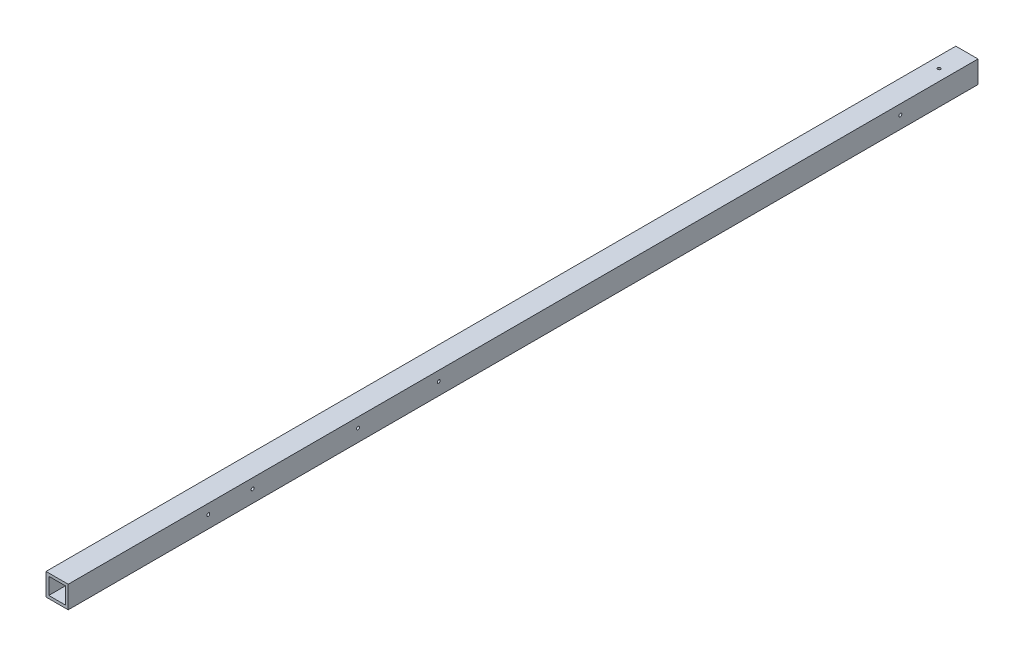
ISO-10303-21;
HEADER;
FILE_DESCRIPTION(('STEP AP214'),'2;1');
FILE_NAME('part.step','',(''),(''),'','','');
FILE_SCHEMA(('AUTOMOTIVE_DESIGN { 1 0 10303 214 1 1 1 1 }'));
ENDSEC;
DATA;
#1=APPLICATION_CONTEXT('core data for automotive mechanical design processes');
#2=APPLICATION_PROTOCOL_DEFINITION('international standard','automotive_design',2000,#1);
#3=PRODUCT_CONTEXT('',#1,'mechanical');
#4=PRODUCT('Part','Part','',(#3));
#5=PRODUCT_RELATED_PRODUCT_CATEGORY('part','',(#4));
#6=PRODUCT_DEFINITION_FORMATION('','',#4);
#7=PRODUCT_DEFINITION_CONTEXT('part definition',#1,'design');
#8=PRODUCT_DEFINITION('design','',#6,#7);
#9=PRODUCT_DEFINITION_SHAPE('','',#8);
#10=(LENGTH_UNIT() NAMED_UNIT(*) SI_UNIT(.MILLI.,.METRE.));
#11=(NAMED_UNIT(*) PLANE_ANGLE_UNIT() SI_UNIT($,.RADIAN.));
#12=(NAMED_UNIT(*) SI_UNIT($,.STERADIAN.) SOLID_ANGLE_UNIT());
#13=UNCERTAINTY_MEASURE_WITH_UNIT(LENGTH_MEASURE(1.E-05),#10,'distance_accuracy_value','');
#14=(GEOMETRIC_REPRESENTATION_CONTEXT(3) GLOBAL_UNCERTAINTY_ASSIGNED_CONTEXT((#13)) GLOBAL_UNIT_ASSIGNED_CONTEXT((#10,
#11,#12)) REPRESENTATION_CONTEXT('',''));
#15=CARTESIAN_POINT('',(0.,0.,0.));
#16=DIRECTION('',(0.,0.,1.));
#17=DIRECTION('',(1.,0.,0.));
#18=AXIS2_PLACEMENT_3D('',#15,#16,#17);
#19=CARTESIAN_POINT('',(-2287.62139438171,193.675,1762.125));
#20=DIRECTION('',(1.,0.,0.));
#21=DIRECTION('',(0.,0.,-1.));
#22=AXIS2_PLACEMENT_3D('',#19,#20,#21);
#23=CYLINDRICAL_SURFACE('',#22,3.3782);
#24=CARTESIAN_POINT('',(-209.55,193.675,1762.125));
#25=DIRECTION('',(-1.,0.,0.));
#26=DIRECTION('',(0.,0.,-1.));
#27=AXIS2_PLACEMENT_3D('',#24,#25,#26);
#28=CIRCLE('',#27,3.3782);
#29=CARTESIAN_POINT('',(-209.55,193.675,1758.7468));
#30=VERTEX_POINT('',#29);
#31=EDGE_CURVE('E195',#30,#30,#28,.F.);
#32=ORIENTED_EDGE('',*,*,#31,.T.);
#33=EDGE_LOOP('',(#32));
#34=FACE_BOUND('',#33,.T.);
#35=CARTESIAN_POINT('',(-212.028435125498,193.675,1762.125));
#36=DIRECTION('',(1.,0.,0.));
#37=DIRECTION('',(0.,0.,1.));
#38=AXIS2_PLACEMENT_3D('',#35,#36,#37);
#39=CIRCLE('',#38,3.3782);
#40=CARTESIAN_POINT('',(-212.028435125498,193.675,1765.5032));
#41=VERTEX_POINT('',#40);
#42=EDGE_CURVE('E259',#41,#41,#39,.T.);
#43=ORIENTED_EDGE('',*,*,#42,.F.);
#44=EDGE_LOOP('',(#43));
#45=FACE_BOUND('',#44,.T.);
#46=ADVANCED_FACE('F14',(#34,#45),#23,.F.);
#47=CARTESIAN_POINT('',(-2287.62139438171,193.675,1660.525));
#48=DIRECTION('',(1.,0.,0.));
#49=DIRECTION('',(0.,0.,-1.));
#50=AXIS2_PLACEMENT_3D('',#47,#48,#49);
#51=CYLINDRICAL_SURFACE('',#50,3.3782);
#52=CARTESIAN_POINT('',(-209.55,193.675,1660.525));
#53=DIRECTION('',(-1.,0.,0.));
#54=DIRECTION('',(0.,0.,-1.));
#55=AXIS2_PLACEMENT_3D('',#52,#53,#54);
#56=CIRCLE('',#55,3.3782);
#57=CARTESIAN_POINT('',(-209.55,193.675,1657.1468));
#58=VERTEX_POINT('',#57);
#59=EDGE_CURVE('E201',#58,#58,#56,.F.);
#60=ORIENTED_EDGE('',*,*,#59,.T.);
#61=EDGE_LOOP('',(#60));
#62=FACE_BOUND('',#61,.T.);
#63=CARTESIAN_POINT('',(-212.028435125498,193.675,1660.525));
#64=DIRECTION('',(1.,0.,0.));
#65=DIRECTION('',(0.,0.,1.));
#66=AXIS2_PLACEMENT_3D('',#63,#64,#65);
#67=CIRCLE('',#66,3.3782);
#68=CARTESIAN_POINT('',(-212.028435125498,193.675,1663.9032));
#69=VERTEX_POINT('',#68);
#70=EDGE_CURVE('E206',#69,#69,#67,.T.);
#71=ORIENTED_EDGE('',*,*,#70,.F.);
#72=EDGE_LOOP('',(#71));
#73=FACE_BOUND('',#72,.T.);
#74=ADVANCED_FACE('F337',(#62,#73),#51,.F.);
#75=CARTESIAN_POINT('',(-190.5,171.45,2082.8));
#76=DIRECTION('',(0.,1.,0.));
#77=DIRECTION('',(0.,0.,-1.));
#78=AXIS2_PLACEMENT_3D('',#75,#76,#77);
#79=PLANE('',#78);
#80=CARTESIAN_POINT('',(-190.5,171.45,63.5));
#81=DIRECTION('',(0.,-1.,0.));
#82=DIRECTION('',(0.,0.,-1.));
#83=AXIS2_PLACEMENT_3D('',#80,#81,#82);
#84=CIRCLE('',#83,3.3655);
#85=CARTESIAN_POINT('',(-190.5,171.45,60.1345));
#86=VERTEX_POINT('',#85);
#87=EDGE_CURVE('E148',#86,#86,#84,.F.);
#88=ORIENTED_EDGE('',*,*,#87,.F.);
#89=EDGE_LOOP('',(#88));
#90=FACE_BOUND('',#89,.T.);
#91=DIRECTION('',(-1.,0.,0.));
#92=VECTOR('',#91,1.);
#93=CARTESIAN_POINT('',(-190.5,171.45,0.));
#94=LINE('',#93,#92);
#95=CARTESIAN_POINT('',(-171.45,171.45,0.));
#96=VERTEX_POINT('',#95);
#97=CARTESIAN_POINT('',(-209.55,171.45,0.));
#98=VERTEX_POINT('',#97);
#99=EDGE_CURVE('E159',#96,#98,#94,.T.);
#100=ORIENTED_EDGE('',*,*,#99,.T.);
#101=DIRECTION('',(0.,0.,-1.));
#102=VECTOR('',#101,1.);
#103=CARTESIAN_POINT('',(-209.55,171.45,2082.8));
#104=LINE('',#103,#102);
#105=CARTESIAN_POINT('',(-209.55,171.45,2082.8));
#106=VERTEX_POINT('',#105);
#107=EDGE_CURVE('E169',#106,#98,#104,.T.);
#108=ORIENTED_EDGE('',*,*,#107,.F.);
#109=DIRECTION('',(-1.,0.,0.));
#110=VECTOR('',#109,1.);
#111=CARTESIAN_POINT('',(-190.5,171.45,2082.8));
#112=LINE('',#111,#110);
#113=CARTESIAN_POINT('',(-171.45,171.45,2082.8));
#114=VERTEX_POINT('',#113);
#115=EDGE_CURVE('E130',#114,#106,#112,.T.);
#116=ORIENTED_EDGE('',*,*,#115,.F.);
#117=DIRECTION('',(0.,0.,-1.));
#118=VECTOR('',#117,1.);
#119=CARTESIAN_POINT('',(-171.45,171.45,2082.8));
#120=LINE('',#119,#118);
#121=EDGE_CURVE('E9',#114,#96,#120,.T.);
#122=ORIENTED_EDGE('',*,*,#121,.T.);
#123=EDGE_LOOP('',(#100,#108,#116,#122));
#124=FACE_BOUND('',#123,.T.);
#125=ADVANCED_FACE('F320',(#90,#124),#79,.T.);
#126=CARTESIAN_POINT('',(-171.45,190.5,2082.8));
#127=DIRECTION('',(1.,0.,0.));
#128=DIRECTION('',(0.,0.,-1.));
#129=AXIS2_PLACEMENT_3D('',#126,#127,#128);
#130=PLANE('',#129);
#131=CARTESIAN_POINT('',(-171.45,193.675,1419.225));
#132=DIRECTION('',(1.,0.,0.));
#133=DIRECTION('',(0.,0.,-1.));
#134=AXIS2_PLACEMENT_3D('',#131,#132,#133);
#135=CIRCLE('',#134,3.3782);
#136=CARTESIAN_POINT('',(-171.45,193.675,1415.8468));
#137=VERTEX_POINT('',#136);
#138=EDGE_CURVE('E235',#137,#137,#135,.F.);
#139=ORIENTED_EDGE('',*,*,#138,.F.);
#140=EDGE_LOOP('',(#139));
#141=FACE_BOUND('',#140,.T.);
#142=CARTESIAN_POINT('',(-171.45,193.675,177.8));
#143=DIRECTION('',(-1.,0.,0.));
#144=DIRECTION('',(0.,0.,-1.));
#145=AXIS2_PLACEMENT_3D('',#142,#143,#144);
#146=CIRCLE('',#145,3.3782);
#147=CARTESIAN_POINT('',(-171.45,193.675,174.4218));
#148=VERTEX_POINT('',#147);
#149=EDGE_CURVE('E224',#148,#148,#146,.F.);
#150=ORIENTED_EDGE('',*,*,#149,.T.);
#151=EDGE_LOOP('',(#150));
#152=FACE_BOUND('',#151,.T.);
#153=CARTESIAN_POINT('',(-171.45,193.675,1234.5416));
#154=DIRECTION('',(-1.,0.,0.));
#155=DIRECTION('',(0.,0.,-1.));
#156=AXIS2_PLACEMENT_3D('',#153,#154,#155);
#157=CIRCLE('',#156,3.3782);
#158=CARTESIAN_POINT('',(-171.45,193.675,1231.1634));
#159=VERTEX_POINT('',#158);
#160=EDGE_CURVE('E251',#159,#159,#157,.F.);
#161=ORIENTED_EDGE('',*,*,#160,.T.);
#162=EDGE_LOOP('',(#161));
#163=FACE_BOUND('',#162,.T.);
#164=CARTESIAN_POINT('',(-171.45,193.675,1660.525));
#165=DIRECTION('',(-1.,0.,0.));
#166=DIRECTION('',(0.,0.,-1.));
#167=AXIS2_PLACEMENT_3D('',#164,#165,#166);
#168=CIRCLE('',#167,3.3782);
#169=CARTESIAN_POINT('',(-171.45,193.675,1657.1468));
#170=VERTEX_POINT('',#169);
#171=EDGE_CURVE('E200',#170,#170,#168,.F.);
#172=ORIENTED_EDGE('',*,*,#171,.T.);
#173=EDGE_LOOP('',(#172));
#174=FACE_BOUND('',#173,.T.);
#175=CARTESIAN_POINT('',(-171.45,193.675,1762.125));
#176=DIRECTION('',(-1.,0.,0.));
#177=DIRECTION('',(0.,0.,-1.));
#178=AXIS2_PLACEMENT_3D('',#175,#176,#177);
#179=CIRCLE('',#178,3.3782);
#180=CARTESIAN_POINT('',(-171.45,193.675,1758.7468));
#181=VERTEX_POINT('',#180);
#182=EDGE_CURVE('E279',#181,#181,#179,.F.);
#183=ORIENTED_EDGE('',*,*,#182,.T.);
#184=EDGE_LOOP('',(#183));
#185=FACE_BOUND('',#184,.T.);
#186=DIRECTION('',(0.,1.,0.));
#187=VECTOR('',#186,1.);
#188=CARTESIAN_POINT('',(-171.45,190.5,0.));
#189=LINE('',#188,#187);
#190=CARTESIAN_POINT('',(-171.45,209.55,0.));
#191=VERTEX_POINT('',#190);
#192=EDGE_CURVE('E163',#96,#191,#189,.T.);
#193=ORIENTED_EDGE('',*,*,#192,.F.);
#194=ORIENTED_EDGE('',*,*,#121,.F.);
#195=DIRECTION('',(0.,1.,0.));
#196=VECTOR('',#195,1.);
#197=CARTESIAN_POINT('',(-171.45,190.5,2082.8));
#198=LINE('',#197,#196);
#199=CARTESIAN_POINT('',(-171.45,209.55,2082.8));
#200=VERTEX_POINT('',#199);
#201=EDGE_CURVE('E114',#114,#200,#198,.T.);
#202=ORIENTED_EDGE('',*,*,#201,.T.);
#203=DIRECTION('',(0.,0.,-1.));
#204=VECTOR('',#203,1.);
#205=CARTESIAN_POINT('',(-171.45,209.55,2082.8));
#206=LINE('',#205,#204);
#207=EDGE_CURVE('E25',#200,#191,#206,.T.);
#208=ORIENTED_EDGE('',*,*,#207,.T.);
#209=EDGE_LOOP('',(#193,#194,#202,#208));
#210=FACE_BOUND('',#209,.T.);
#211=ADVANCED_FACE('F127',(#141,#152,#163,#174,#185,#210),#130,.F.);
#212=CARTESIAN_POINT('',(-190.5,209.55,2082.8));
#213=DIRECTION('',(0.,1.,0.));
#214=DIRECTION('',(0.,0.,-1.));
#215=AXIS2_PLACEMENT_3D('',#212,#213,#214);
#216=PLANE('',#215);
#217=CARTESIAN_POINT('',(-190.5,209.55,63.5));
#218=DIRECTION('',(0.,-1.,0.));
#219=DIRECTION('',(0.,0.,-1.));
#220=AXIS2_PLACEMENT_3D('',#217,#218,#219);
#221=CIRCLE('',#220,3.3655);
#222=CARTESIAN_POINT('',(-190.5,209.55,60.1345));
#223=VERTEX_POINT('',#222);
#224=EDGE_CURVE('E193',#223,#223,#221,.F.);
#225=ORIENTED_EDGE('',*,*,#224,.T.);
#226=EDGE_LOOP('',(#225));
#227=FACE_BOUND('',#226,.T.);
#228=DIRECTION('',(-1.,0.,0.));
#229=VECTOR('',#228,1.);
#230=CARTESIAN_POINT('',(-190.5,209.55,0.));
#231=LINE('',#230,#229);
#232=CARTESIAN_POINT('',(-209.55,209.55,0.));
#233=VERTEX_POINT('',#232);
#234=EDGE_CURVE('E121',#191,#233,#231,.T.);
#235=ORIENTED_EDGE('',*,*,#234,.F.);
#236=ORIENTED_EDGE('',*,*,#207,.F.);
#237=DIRECTION('',(-1.,0.,0.));
#238=VECTOR('',#237,1.);
#239=CARTESIAN_POINT('',(-190.5,209.55,2082.8));
#240=LINE('',#239,#238);
#241=CARTESIAN_POINT('',(-209.55,209.55,2082.8));
#242=VERTEX_POINT('',#241);
#243=EDGE_CURVE('E110',#200,#242,#240,.T.);
#244=ORIENTED_EDGE('',*,*,#243,.T.);
#245=DIRECTION('',(0.,0.,-1.));
#246=VECTOR('',#245,1.);
#247=CARTESIAN_POINT('',(-209.55,209.55,2082.8));
#248=LINE('',#247,#246);
#249=EDGE_CURVE('E125',#242,#233,#248,.T.);
#250=ORIENTED_EDGE('',*,*,#249,.T.);
#251=EDGE_LOOP('',(#235,#236,#244,#250));
#252=FACE_BOUND('',#251,.T.);
#253=ADVANCED_FACE('F120',(#227,#252),#216,.F.);
#254=CARTESIAN_POINT('',(-215.9,190.5,2082.8));
#255=DIRECTION('',(-1.,0.,0.));
#256=DIRECTION('',(0.,0.,1.));
#257=AXIS2_PLACEMENT_3D('',#254,#255,#256);
#258=PLANE('',#257);
#259=CARTESIAN_POINT('',(-215.9,193.675,1419.225));
#260=DIRECTION('',(-1.,0.,0.));
#261=DIRECTION('',(0.,0.,1.));
#262=AXIS2_PLACEMENT_3D('',#259,#260,#261);
#263=CIRCLE('',#262,6.74369999999991);
#264=CARTESIAN_POINT('',(-215.9,193.675,1425.9687));
#265=VERTEX_POINT('',#264);
#266=EDGE_CURVE('E392',#265,#265,#263,.T.);
#267=ORIENTED_EDGE('',*,*,#266,.F.);
#268=EDGE_LOOP('',(#267));
#269=FACE_BOUND('',#268,.T.);
#270=CARTESIAN_POINT('',(-215.9,193.675,177.8));
#271=DIRECTION('',(1.,0.,0.));
#272=DIRECTION('',(0.,0.,1.));
#273=AXIS2_PLACEMENT_3D('',#270,#271,#272);
#274=CIRCLE('',#273,6.7437);
#275=CARTESIAN_POINT('',(-215.9,193.675,184.5437));
#276=VERTEX_POINT('',#275);
#277=EDGE_CURVE('E228',#276,#276,#274,.T.);
#278=ORIENTED_EDGE('',*,*,#277,.T.);
#279=EDGE_LOOP('',(#278));
#280=FACE_BOUND('',#279,.T.);
#281=CARTESIAN_POINT('',(-215.9,193.675,1234.5416));
#282=DIRECTION('',(1.,0.,0.));
#283=DIRECTION('',(0.,0.,1.));
#284=AXIS2_PLACEMENT_3D('',#281,#282,#283);
#285=CIRCLE('',#284,6.74369999999991);
#286=CARTESIAN_POINT('',(-215.9,193.675,1241.2853));
#287=VERTEX_POINT('',#286);
#288=EDGE_CURVE('E241',#287,#287,#285,.T.);
#289=ORIENTED_EDGE('',*,*,#288,.T.);
#290=EDGE_LOOP('',(#289));
#291=FACE_BOUND('',#290,.T.);
#292=CARTESIAN_POINT('',(-215.9,193.675,1762.125));
#293=DIRECTION('',(1.,0.,0.));
#294=DIRECTION('',(0.,0.,1.));
#295=AXIS2_PLACEMENT_3D('',#292,#293,#294);
#296=CIRCLE('',#295,6.74369999999991);
#297=CARTESIAN_POINT('',(-215.9,193.675,1768.8687));
#298=VERTEX_POINT('',#297);
#299=EDGE_CURVE('E255',#298,#298,#296,.T.);
#300=ORIENTED_EDGE('',*,*,#299,.T.);
#301=EDGE_LOOP('',(#300));
#302=FACE_BOUND('',#301,.T.);
#303=CARTESIAN_POINT('',(-215.9,193.675,1660.525));
#304=DIRECTION('',(1.,0.,0.));
#305=DIRECTION('',(0.,0.,1.));
#306=AXIS2_PLACEMENT_3D('',#303,#304,#305);
#307=CIRCLE('',#306,6.74369999999991);
#308=CARTESIAN_POINT('',(-215.9,193.675,1667.2687));
#309=VERTEX_POINT('',#308);
#310=EDGE_CURVE('E263',#309,#309,#307,.T.);
#311=ORIENTED_EDGE('',*,*,#310,.T.);
#312=EDGE_LOOP('',(#311));
#313=FACE_BOUND('',#312,.T.);
#314=DIRECTION('',(0.,-1.,0.));
#315=VECTOR('',#314,1.);
#316=CARTESIAN_POINT('',(-215.9,190.5,0.));
#317=LINE('',#316,#315);
#318=CARTESIAN_POINT('',(-215.9,215.9,0.));
#319=VERTEX_POINT('',#318);
#320=CARTESIAN_POINT('',(-215.9,165.1,0.));
#321=VERTEX_POINT('',#320);
#322=EDGE_CURVE('E143',#319,#321,#317,.T.);
#323=ORIENTED_EDGE('',*,*,#322,.T.);
#324=DIRECTION('',(0.,0.,-1.));
#325=VECTOR('',#324,1.);
#326=CARTESIAN_POINT('',(-215.9,165.1,2082.8));
#327=LINE('',#326,#325);
#328=CARTESIAN_POINT('',(-215.9,165.1,2082.8));
#329=VERTEX_POINT('',#328);
#330=EDGE_CURVE('E142',#329,#321,#327,.T.);
#331=ORIENTED_EDGE('',*,*,#330,.F.);
#332=DIRECTION('',(0.,-1.,0.));
#333=VECTOR('',#332,1.);
#334=CARTESIAN_POINT('',(-215.9,190.5,2082.8));
#335=LINE('',#334,#333);
#336=CARTESIAN_POINT('',(-215.9,215.9,2082.8));
#337=VERTEX_POINT('',#336);
#338=EDGE_CURVE('E168',#337,#329,#335,.T.);
#339=ORIENTED_EDGE('',*,*,#338,.F.);
#340=DIRECTION('',(0.,0.,-1.));
#341=VECTOR('',#340,1.);
#342=CARTESIAN_POINT('',(-215.9,215.9,2082.8));
#343=LINE('',#342,#341);
#344=EDGE_CURVE('E172',#337,#319,#343,.T.);
#345=ORIENTED_EDGE('',*,*,#344,.T.);
#346=EDGE_LOOP('',(#323,#331,#339,#345));
#347=FACE_BOUND('',#346,.T.);
#348=ADVANCED_FACE('F16',(#269,#280,#291,#302,#313,#347),#258,.T.);
#349=CARTESIAN_POINT('',(-190.5,215.9,2082.8));
#350=DIRECTION('',(0.,-1.,0.));
#351=DIRECTION('',(0.,0.,1.));
#352=AXIS2_PLACEMENT_3D('',#349,#350,#351);
#353=PLANE('',#352);
#354=CARTESIAN_POINT('',(-190.5,215.9,63.5));
#355=DIRECTION('',(0.,-1.,0.));
#356=DIRECTION('',(0.,0.,-1.));
#357=AXIS2_PLACEMENT_3D('',#354,#355,#356);
#358=CIRCLE('',#357,3.3655);
#359=CARTESIAN_POINT('',(-190.5,215.9,60.1345));
#360=VERTEX_POINT('',#359);
#361=EDGE_CURVE('E194',#360,#360,#358,.T.);
#362=ORIENTED_EDGE('',*,*,#361,.T.);
#363=EDGE_LOOP('',(#362));
#364=FACE_BOUND('',#363,.T.);
#365=DIRECTION('',(1.,0.,0.));
#366=VECTOR('',#365,1.);
#367=CARTESIAN_POINT('',(-190.5,215.9,0.));
#368=LINE('',#367,#366);
#369=CARTESIAN_POINT('',(-165.1,215.9,0.));
#370=VERTEX_POINT('',#369);
#371=EDGE_CURVE('E147',#319,#370,#368,.T.);
#372=ORIENTED_EDGE('',*,*,#371,.F.);
#373=ORIENTED_EDGE('',*,*,#344,.F.);
#374=DIRECTION('',(1.,0.,0.));
#375=VECTOR('',#374,1.);
#376=CARTESIAN_POINT('',(-190.5,215.9,2082.8));
#377=LINE('',#376,#375);
#378=CARTESIAN_POINT('',(-165.1,215.9,2082.8));
#379=VERTEX_POINT('',#378);
#380=EDGE_CURVE('E91',#337,#379,#377,.T.);
#381=ORIENTED_EDGE('',*,*,#380,.T.);
#382=DIRECTION('',(0.,0.,-1.));
#383=VECTOR('',#382,1.);
#384=CARTESIAN_POINT('',(-165.1,215.9,2082.8));
#385=LINE('',#384,#383);
#386=EDGE_CURVE('E182',#379,#370,#385,.T.);
#387=ORIENTED_EDGE('',*,*,#386,.T.);
#388=EDGE_LOOP('',(#372,#373,#381,#387));
#389=FACE_BOUND('',#388,.T.);
#390=ADVANCED_FACE('F310',(#364,#389),#353,.F.);
#391=CARTESIAN_POINT('',(-165.1,190.5,2082.8));
#392=DIRECTION('',(-1.,0.,0.));
#393=DIRECTION('',(0.,0.,1.));
#394=AXIS2_PLACEMENT_3D('',#391,#392,#393);
#395=PLANE('',#394);
#396=CARTESIAN_POINT('',(-165.1,193.675,1419.225));
#397=DIRECTION('',(-1.,0.,0.));
#398=DIRECTION('',(0.,0.,1.));
#399=AXIS2_PLACEMENT_3D('',#396,#397,#398);
#400=CIRCLE('',#399,3.3782);
#401=CARTESIAN_POINT('',(-165.1,193.675,1422.6032));
#402=VERTEX_POINT('',#401);
#403=EDGE_CURVE('E453',#402,#402,#400,.F.);
#404=ORIENTED_EDGE('',*,*,#403,.F.);
#405=EDGE_LOOP('',(#404));
#406=FACE_BOUND('',#405,.T.);
#407=CARTESIAN_POINT('',(-165.1,193.675,177.8));
#408=DIRECTION('',(1.,0.,0.));
#409=DIRECTION('',(0.,0.,1.));
#410=AXIS2_PLACEMENT_3D('',#407,#408,#409);
#411=CIRCLE('',#410,3.3782);
#412=CARTESIAN_POINT('',(-165.1,193.675,181.1782));
#413=VERTEX_POINT('',#412);
#414=EDGE_CURVE('E215',#413,#413,#411,.F.);
#415=ORIENTED_EDGE('',*,*,#414,.T.);
#416=EDGE_LOOP('',(#415));
#417=FACE_BOUND('',#416,.T.);
#418=CARTESIAN_POINT('',(-165.1,193.675,1234.5416));
#419=DIRECTION('',(1.,0.,0.));
#420=DIRECTION('',(0.,0.,1.));
#421=AXIS2_PLACEMENT_3D('',#418,#419,#420);
#422=CIRCLE('',#421,3.3782);
#423=CARTESIAN_POINT('',(-165.1,193.675,1237.9198));
#424=VERTEX_POINT('',#423);
#425=EDGE_CURVE('E210',#424,#424,#422,.F.);
#426=ORIENTED_EDGE('',*,*,#425,.T.);
#427=EDGE_LOOP('',(#426));
#428=FACE_BOUND('',#427,.T.);
#429=CARTESIAN_POINT('',(-165.1,193.675,1660.525));
#430=DIRECTION('',(1.,0.,0.));
#431=DIRECTION('',(0.,0.,1.));
#432=AXIS2_PLACEMENT_3D('',#429,#430,#431);
#433=CIRCLE('',#432,3.3782);
#434=CARTESIAN_POINT('',(-165.1,193.675,1663.9032));
#435=VERTEX_POINT('',#434);
#436=EDGE_CURVE('E205',#435,#435,#433,.F.);
#437=ORIENTED_EDGE('',*,*,#436,.T.);
#438=EDGE_LOOP('',(#437));
#439=FACE_BOUND('',#438,.T.);
#440=CARTESIAN_POINT('',(-165.1,193.675,1762.125));
#441=DIRECTION('',(1.,0.,0.));
#442=DIRECTION('',(0.,0.,1.));
#443=AXIS2_PLACEMENT_3D('',#440,#441,#442);
#444=CIRCLE('',#443,3.3782);
#445=CARTESIAN_POINT('',(-165.1,193.675,1765.5032));
#446=VERTEX_POINT('',#445);
#447=EDGE_CURVE('E199',#446,#446,#444,.F.);
#448=ORIENTED_EDGE('',*,*,#447,.T.);
#449=EDGE_LOOP('',(#448));
#450=FACE_BOUND('',#449,.T.);
#451=DIRECTION('',(0.,-1.,0.));
#452=VECTOR('',#451,1.);
#453=CARTESIAN_POINT('',(-165.1,190.5,0.));
#454=LINE('',#453,#452);
#455=CARTESIAN_POINT('',(-165.1,165.1,0.));
#456=VERTEX_POINT('',#455);
#457=EDGE_CURVE('E152',#370,#456,#454,.T.);
#458=ORIENTED_EDGE('',*,*,#457,.F.);
#459=ORIENTED_EDGE('',*,*,#386,.F.);
#460=DIRECTION('',(0.,-1.,0.));
#461=VECTOR('',#460,1.);
#462=CARTESIAN_POINT('',(-165.1,190.5,2082.8));
#463=LINE('',#462,#461);
#464=CARTESIAN_POINT('',(-165.1,165.1,2082.8));
#465=VERTEX_POINT('',#464);
#466=EDGE_CURVE('E296',#379,#465,#463,.T.);
#467=ORIENTED_EDGE('',*,*,#466,.T.);
#468=DIRECTION('',(0.,0.,-1.));
#469=VECTOR('',#468,1.);
#470=CARTESIAN_POINT('',(-165.1,165.1,2082.8));
#471=LINE('',#470,#469);
#472=EDGE_CURVE('E178',#465,#456,#471,.T.);
#473=ORIENTED_EDGE('',*,*,#472,.T.);
#474=EDGE_LOOP('',(#458,#459,#467,#473));
#475=FACE_BOUND('',#474,.T.);
#476=ADVANCED_FACE('F308',(#406,#417,#428,#439,#450,#475),#395,.F.);
#477=CARTESIAN_POINT('',(-190.5,165.1,2082.8));
#478=DIRECTION('',(0.,-1.,0.));
#479=DIRECTION('',(0.,0.,1.));
#480=AXIS2_PLACEMENT_3D('',#477,#478,#479);
#481=PLANE('',#480);
#482=CARTESIAN_POINT('',(-190.5,165.1,63.5));
#483=DIRECTION('',(0.,1.,0.));
#484=DIRECTION('',(0.,0.,1.));
#485=AXIS2_PLACEMENT_3D('',#482,#483,#484);
#486=CIRCLE('',#485,3.3655);
#487=CARTESIAN_POINT('',(-190.5,165.1,66.8655));
#488=VERTEX_POINT('',#487);
#489=EDGE_CURVE('E189',#488,#488,#486,.F.);
#490=ORIENTED_EDGE('',*,*,#489,.F.);
#491=EDGE_LOOP('',(#490));
#492=FACE_BOUND('',#491,.T.);
#493=DIRECTION('',(1.,0.,0.));
#494=VECTOR('',#493,1.);
#495=CARTESIAN_POINT('',(-190.5,165.1,0.));
#496=LINE('',#495,#494);
#497=EDGE_CURVE('E156',#321,#456,#496,.T.);
#498=ORIENTED_EDGE('',*,*,#497,.T.);
#499=ORIENTED_EDGE('',*,*,#472,.F.);
#500=DIRECTION('',(1.,0.,0.));
#501=VECTOR('',#500,1.);
#502=CARTESIAN_POINT('',(-190.5,165.1,2082.8));
#503=LINE('',#502,#501);
#504=EDGE_CURVE('E136',#329,#465,#503,.T.);
#505=ORIENTED_EDGE('',*,*,#504,.F.);
#506=ORIENTED_EDGE('',*,*,#330,.T.);
#507=EDGE_LOOP('',(#498,#499,#505,#506));
#508=FACE_BOUND('',#507,.T.);
#509=ADVANCED_FACE('F306',(#492,#508),#481,.T.);
#510=CARTESIAN_POINT('',(-209.55,190.5,2082.8));
#511=DIRECTION('',(1.,0.,0.));
#512=DIRECTION('',(0.,0.,-1.));
#513=AXIS2_PLACEMENT_3D('',#510,#511,#512);
#514=PLANE('',#513);
#515=CARTESIAN_POINT('',(-209.55,193.675,1419.225));
#516=DIRECTION('',(1.,0.,0.));
#517=DIRECTION('',(0.,0.,-1.));
#518=AXIS2_PLACEMENT_3D('',#515,#516,#517);
#519=CIRCLE('',#518,3.3782);
#520=CARTESIAN_POINT('',(-209.55,193.675,1415.8468));
#521=VERTEX_POINT('',#520);
#522=EDGE_CURVE('E18',#521,#521,#519,.F.);
#523=ORIENTED_EDGE('',*,*,#522,.T.);
#524=EDGE_LOOP('',(#523));
#525=FACE_BOUND('',#524,.T.);
#526=CARTESIAN_POINT('',(-209.55,193.675,177.8));
#527=DIRECTION('',(-1.,0.,0.));
#528=DIRECTION('',(0.,0.,-1.));
#529=AXIS2_PLACEMENT_3D('',#526,#527,#528);
#530=CIRCLE('',#529,3.3782);
#531=CARTESIAN_POINT('',(-209.55,193.675,174.4218));
#532=VERTEX_POINT('',#531);
#533=EDGE_CURVE('E212',#532,#532,#530,.F.);
#534=ORIENTED_EDGE('',*,*,#533,.F.);
#535=EDGE_LOOP('',(#534));
#536=FACE_BOUND('',#535,.T.);
#537=CARTESIAN_POINT('',(-209.55,193.675,1234.5416));
#538=DIRECTION('',(-1.,0.,0.));
#539=DIRECTION('',(0.,0.,-1.));
#540=AXIS2_PLACEMENT_3D('',#537,#538,#539);
#541=CIRCLE('',#540,3.3782);
#542=CARTESIAN_POINT('',(-209.55,193.675,1231.1634));
#543=VERTEX_POINT('',#542);
#544=EDGE_CURVE('E207',#543,#543,#541,.F.);
#545=ORIENTED_EDGE('',*,*,#544,.F.);
#546=EDGE_LOOP('',(#545));
#547=FACE_BOUND('',#546,.T.);
#548=ORIENTED_EDGE('',*,*,#59,.F.);
#549=EDGE_LOOP('',(#548));
#550=FACE_BOUND('',#549,.T.);
#551=ORIENTED_EDGE('',*,*,#31,.F.);
#552=EDGE_LOOP('',(#551));
#553=FACE_BOUND('',#552,.T.);
#554=DIRECTION('',(0.,1.,0.));
#555=VECTOR('',#554,1.);
#556=CARTESIAN_POINT('',(-209.55,190.5,0.));
#557=LINE('',#556,#555);
#558=EDGE_CURVE('E74',#98,#233,#557,.T.);
#559=ORIENTED_EDGE('',*,*,#558,.T.);
#560=ORIENTED_EDGE('',*,*,#249,.F.);
#561=DIRECTION('',(0.,1.,0.));
#562=VECTOR('',#561,1.);
#563=CARTESIAN_POINT('',(-209.55,190.5,2082.8));
#564=LINE('',#563,#562);
#565=EDGE_CURVE('E39',#106,#242,#564,.T.);
#566=ORIENTED_EDGE('',*,*,#565,.F.);
#567=ORIENTED_EDGE('',*,*,#107,.T.);
#568=EDGE_LOOP('',(#559,#560,#566,#567));
#569=FACE_BOUND('',#568,.T.);
#570=ADVANCED_FACE('F321',(#525,#536,#547,#550,#553,#569),#514,.T.);
#571=CARTESIAN_POINT('',(-190.5,190.5,2082.8));
#572=DIRECTION('',(0.,0.,1.));
#573=DIRECTION('',(1.,0.,0.));
#574=AXIS2_PLACEMENT_3D('',#571,#572,#573);
#575=PLANE('',#574);
#576=ORIENTED_EDGE('',*,*,#338,.T.);
#577=ORIENTED_EDGE('',*,*,#504,.T.);
#578=ORIENTED_EDGE('',*,*,#466,.F.);
#579=ORIENTED_EDGE('',*,*,#380,.F.);
#580=EDGE_LOOP('',(#576,#577,#578,#579));
#581=FACE_BOUND('',#580,.T.);
#582=ORIENTED_EDGE('',*,*,#115,.T.);
#583=ORIENTED_EDGE('',*,*,#565,.T.);
#584=ORIENTED_EDGE('',*,*,#243,.F.);
#585=ORIENTED_EDGE('',*,*,#201,.F.);
#586=EDGE_LOOP('',(#582,#583,#584,#585));
#587=FACE_BOUND('',#586,.T.);
#588=ADVANCED_FACE('F112',(#581,#587),#575,.T.);
#589=CARTESIAN_POINT('',(-190.5,190.5,0.));
#590=DIRECTION('',(0.,0.,1.));
#591=DIRECTION('',(1.,0.,0.));
#592=AXIS2_PLACEMENT_3D('',#589,#590,#591);
#593=PLANE('',#592);
#594=ORIENTED_EDGE('',*,*,#322,.F.);
#595=ORIENTED_EDGE('',*,*,#371,.T.);
#596=ORIENTED_EDGE('',*,*,#457,.T.);
#597=ORIENTED_EDGE('',*,*,#497,.F.);
#598=EDGE_LOOP('',(#594,#595,#596,#597));
#599=FACE_BOUND('',#598,.T.);
#600=ORIENTED_EDGE('',*,*,#99,.F.);
#601=ORIENTED_EDGE('',*,*,#192,.T.);
#602=ORIENTED_EDGE('',*,*,#234,.T.);
#603=ORIENTED_EDGE('',*,*,#558,.F.);
#604=EDGE_LOOP('',(#600,#601,#602,#603));
#605=FACE_BOUND('',#604,.T.);
#606=ADVANCED_FACE('F314',(#599,#605),#593,.F.);
#607=CARTESIAN_POINT('',(-190.5,-1869.1497542781,63.5));
#608=DIRECTION('',(0.,1.,0.));
#609=DIRECTION('',(0.,0.,-1.));
#610=AXIS2_PLACEMENT_3D('',#607,#608,#609);
#611=CYLINDRICAL_SURFACE('',#610,3.3655);
#612=ORIENTED_EDGE('',*,*,#87,.T.);
#613=EDGE_LOOP('',(#612));
#614=FACE_BOUND('',#613,.T.);
#615=ORIENTED_EDGE('',*,*,#489,.T.);
#616=EDGE_LOOP('',(#615));
#617=FACE_BOUND('',#616,.T.);
#618=ADVANCED_FACE('F316',(#614,#617),#611,.F.);
#619=ORIENTED_EDGE('',*,*,#361,.F.);
#620=EDGE_LOOP('',(#619));
#621=FACE_BOUND('',#620,.T.);
#622=ORIENTED_EDGE('',*,*,#224,.F.);
#623=EDGE_LOOP('',(#622));
#624=FACE_BOUND('',#623,.T.);
#625=ADVANCED_FACE('F350',(#621,#624),#611,.F.);
#626=ORIENTED_EDGE('',*,*,#447,.F.);
#627=EDGE_LOOP('',(#626));
#628=FACE_BOUND('',#627,.T.);
#629=ORIENTED_EDGE('',*,*,#182,.F.);
#630=EDGE_LOOP('',(#629));
#631=FACE_BOUND('',#630,.T.);
#632=ADVANCED_FACE('F340',(#628,#631),#23,.F.);
#633=ORIENTED_EDGE('',*,*,#436,.F.);
#634=EDGE_LOOP('',(#633));
#635=FACE_BOUND('',#634,.T.);
#636=ORIENTED_EDGE('',*,*,#171,.F.);
#637=EDGE_LOOP('',(#636));
#638=FACE_BOUND('',#637,.T.);
#639=ADVANCED_FACE('F346',(#635,#638),#51,.F.);
#640=CARTESIAN_POINT('',(-212.028435125498,193.675,1660.525));
#641=DIRECTION('',(-1.,0.,0.));
#642=DIRECTION('',(0.,0.,1.));
#643=AXIS2_PLACEMENT_3D('',#640,#641,#642);
#644=CONICAL_SURFACE('',#643,3.3782,0.715584993317698);
#645=ORIENTED_EDGE('',*,*,#310,.F.);
#646=EDGE_LOOP('',(#645));
#647=FACE_BOUND('',#646,.T.);
#648=ORIENTED_EDGE('',*,*,#70,.T.);
#649=EDGE_LOOP('',(#648));
#650=FACE_BOUND('',#649,.T.);
#651=ADVANCED_FACE('F356',(#647,#650),#644,.F.);
#652=CARTESIAN_POINT('',(-212.028435125498,193.675,1762.125));
#653=DIRECTION('',(-1.,0.,0.));
#654=DIRECTION('',(0.,0.,1.));
#655=AXIS2_PLACEMENT_3D('',#652,#653,#654);
#656=CONICAL_SURFACE('',#655,3.3782,0.715584993317698);
#657=ORIENTED_EDGE('',*,*,#299,.F.);
#658=EDGE_LOOP('',(#657));
#659=FACE_BOUND('',#658,.T.);
#660=ORIENTED_EDGE('',*,*,#42,.T.);
#661=EDGE_LOOP('',(#660));
#662=FACE_BOUND('',#661,.T.);
#663=ADVANCED_FACE('F403',(#659,#662),#656,.F.);
#664=CARTESIAN_POINT('',(1869.15356974302,193.675,1234.5416));
#665=DIRECTION('',(-1.,0.,0.));
#666=DIRECTION('',(0.,0.,1.));
#667=AXIS2_PLACEMENT_3D('',#664,#665,#666);
#668=CYLINDRICAL_SURFACE('',#667,3.3782);
#669=ORIENTED_EDGE('',*,*,#544,.T.);
#670=EDGE_LOOP('',(#669));
#671=FACE_BOUND('',#670,.T.);
#672=CARTESIAN_POINT('',(-212.028435125498,193.675,1234.5416));
#673=DIRECTION('',(1.,0.,0.));
#674=DIRECTION('',(0.,0.,1.));
#675=AXIS2_PLACEMENT_3D('',#672,#673,#674);
#676=CIRCLE('',#675,3.3782);
#677=CARTESIAN_POINT('',(-212.028435125498,193.675,1237.9198));
#678=VERTEX_POINT('',#677);
#679=EDGE_CURVE('E211',#678,#678,#676,.T.);
#680=ORIENTED_EDGE('',*,*,#679,.F.);
#681=EDGE_LOOP('',(#680));
#682=FACE_BOUND('',#681,.T.);
#683=ADVANCED_FACE('F410',(#671,#682),#668,.F.);
#684=CARTESIAN_POINT('',(-212.028435125498,193.675,1234.5416));
#685=DIRECTION('',(-1.,0.,0.));
#686=DIRECTION('',(0.,0.,1.));
#687=AXIS2_PLACEMENT_3D('',#684,#685,#686);
#688=CONICAL_SURFACE('',#687,3.3782,0.715584993317698);
#689=ORIENTED_EDGE('',*,*,#288,.F.);
#690=EDGE_LOOP('',(#689));
#691=FACE_BOUND('',#690,.T.);
#692=ORIENTED_EDGE('',*,*,#679,.T.);
#693=EDGE_LOOP('',(#692));
#694=FACE_BOUND('',#693,.T.);
#695=ADVANCED_FACE('F416',(#691,#694),#688,.F.);
#696=ORIENTED_EDGE('',*,*,#425,.F.);
#697=EDGE_LOOP('',(#696));
#698=FACE_BOUND('',#697,.T.);
#699=ORIENTED_EDGE('',*,*,#160,.F.);
#700=EDGE_LOOP('',(#699));
#701=FACE_BOUND('',#700,.T.);
#702=ADVANCED_FACE('F418',(#698,#701),#668,.F.);
#703=CARTESIAN_POINT('',(1869.15356974302,193.675,177.8));
#704=DIRECTION('',(-1.,0.,0.));
#705=DIRECTION('',(0.,0.,1.));
#706=AXIS2_PLACEMENT_3D('',#703,#704,#705);
#707=CYLINDRICAL_SURFACE('',#706,3.3782);
#708=ORIENTED_EDGE('',*,*,#533,.T.);
#709=EDGE_LOOP('',(#708));
#710=FACE_BOUND('',#709,.T.);
#711=CARTESIAN_POINT('',(-212.028435125498,193.675,177.8));
#712=DIRECTION('',(1.,0.,0.));
#713=DIRECTION('',(0.,0.,1.));
#714=AXIS2_PLACEMENT_3D('',#711,#712,#713);
#715=CIRCLE('',#714,3.3782);
#716=CARTESIAN_POINT('',(-212.028435125498,193.675,181.1782));
#717=VERTEX_POINT('',#716);
#718=EDGE_CURVE('E216',#717,#717,#715,.T.);
#719=ORIENTED_EDGE('',*,*,#718,.F.);
#720=EDGE_LOOP('',(#719));
#721=FACE_BOUND('',#720,.T.);
#722=ADVANCED_FACE('F422',(#710,#721),#707,.F.);
#723=CARTESIAN_POINT('',(-212.028435125498,193.675,177.8));
#724=DIRECTION('',(-1.,0.,0.));
#725=DIRECTION('',(0.,0.,1.));
#726=AXIS2_PLACEMENT_3D('',#723,#724,#725);
#727=CONICAL_SURFACE('',#726,3.3782,0.71558499331771);
#728=ORIENTED_EDGE('',*,*,#277,.F.);
#729=EDGE_LOOP('',(#728));
#730=FACE_BOUND('',#729,.T.);
#731=ORIENTED_EDGE('',*,*,#718,.T.);
#732=EDGE_LOOP('',(#731));
#733=FACE_BOUND('',#732,.T.);
#734=ADVANCED_FACE('F425',(#730,#733),#727,.F.);
#735=ORIENTED_EDGE('',*,*,#414,.F.);
#736=EDGE_LOOP('',(#735));
#737=FACE_BOUND('',#736,.T.);
#738=ORIENTED_EDGE('',*,*,#149,.F.);
#739=EDGE_LOOP('',(#738));
#740=FACE_BOUND('',#739,.T.);
#741=ADVANCED_FACE('F426',(#737,#740),#707,.F.);
#742=CARTESIAN_POINT('',(1912.81031480401,193.675,1419.225));
#743=DIRECTION('',(-1.,0.,0.));
#744=DIRECTION('',(0.,0.,1.));
#745=AXIS2_PLACEMENT_3D('',#742,#743,#744);
#746=CYLINDRICAL_SURFACE('',#745,3.3782);
#747=ORIENTED_EDGE('',*,*,#522,.F.);
#748=EDGE_LOOP('',(#747));
#749=FACE_BOUND('',#748,.T.);
#750=CARTESIAN_POINT('',(-212.028435125498,193.675,1419.225));
#751=DIRECTION('',(-1.,0.,0.));
#752=DIRECTION('',(0.,0.,1.));
#753=AXIS2_PLACEMENT_3D('',#750,#751,#752);
#754=CIRCLE('',#753,3.3782);
#755=CARTESIAN_POINT('',(-212.028435125498,193.675,1422.6032));
#756=VERTEX_POINT('',#755);
#757=EDGE_CURVE('E445',#756,#756,#754,.T.);
#758=ORIENTED_EDGE('',*,*,#757,.T.);
#759=EDGE_LOOP('',(#758));
#760=FACE_BOUND('',#759,.T.);
#761=ADVANCED_FACE('F430',(#749,#760),#746,.F.);
#762=CARTESIAN_POINT('',(-212.028435125498,193.675,1419.225));
#763=DIRECTION('',(-1.,0.,0.));
#764=DIRECTION('',(0.,0.,1.));
#765=AXIS2_PLACEMENT_3D('',#762,#763,#764);
#766=CONICAL_SURFACE('',#765,3.3782,0.715584993317756);
#767=ORIENTED_EDGE('',*,*,#266,.T.);
#768=EDGE_LOOP('',(#767));
#769=FACE_BOUND('',#768,.T.);
#770=ORIENTED_EDGE('',*,*,#757,.F.);
#771=EDGE_LOOP('',(#770));
#772=FACE_BOUND('',#771,.T.);
#773=ADVANCED_FACE('F433',(#769,#772),#766,.F.);
#774=ORIENTED_EDGE('',*,*,#403,.T.);
#775=EDGE_LOOP('',(#774));
#776=FACE_BOUND('',#775,.T.);
#777=ORIENTED_EDGE('',*,*,#138,.T.);
#778=EDGE_LOOP('',(#777));
#779=FACE_BOUND('',#778,.T.);
#780=ADVANCED_FACE('F435',(#776,#779),#746,.F.);
#781=CLOSED_SHELL('',(#46,#74,#125,#211,#253,#348,#390,#476,#509,#570,#588,#606,#618,#625,#632,
#639,#651,#663,#683,#695,#702,#722,#734,#741,#761,#773,#780));
#782=MANIFOLD_SOLID_BREP('B1',#781);
#783=ADVANCED_BREP_SHAPE_REPRESENTATION('',(#18,#782),#14);
#784=SHAPE_DEFINITION_REPRESENTATION(#9,#783);
ENDSEC;
END-ISO-10303-21;
